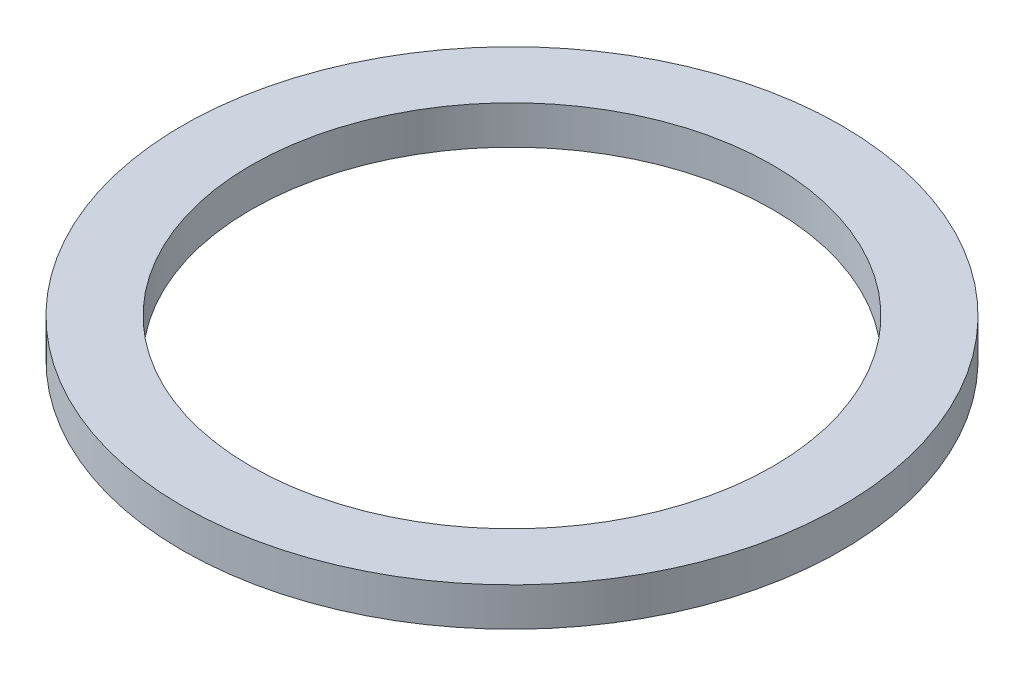
ISO-10303-21;
HEADER;
FILE_DESCRIPTION(('STEP AP214'),'2;1');
FILE_NAME('part.step','',(''),(''),'','','');
FILE_SCHEMA(('AUTOMOTIVE_DESIGN { 1 0 10303 214 1 1 1 1 }'));
ENDSEC;
DATA;
#1=APPLICATION_CONTEXT('core data for automotive mechanical design processes');
#2=APPLICATION_PROTOCOL_DEFINITION('international standard','automotive_design',2000,#1);
#3=PRODUCT_CONTEXT('',#1,'mechanical');
#4=PRODUCT('Part','Part','',(#3));
#5=PRODUCT_RELATED_PRODUCT_CATEGORY('part','',(#4));
#6=PRODUCT_DEFINITION_FORMATION('','',#4);
#7=PRODUCT_DEFINITION_CONTEXT('part definition',#1,'design');
#8=PRODUCT_DEFINITION('design','',#6,#7);
#9=PRODUCT_DEFINITION_SHAPE('','',#8);
#10=(LENGTH_UNIT() NAMED_UNIT(*) SI_UNIT(.MILLI.,.METRE.));
#11=(NAMED_UNIT(*) PLANE_ANGLE_UNIT() SI_UNIT($,.RADIAN.));
#12=(NAMED_UNIT(*) SI_UNIT($,.STERADIAN.) SOLID_ANGLE_UNIT());
#13=UNCERTAINTY_MEASURE_WITH_UNIT(LENGTH_MEASURE(1.E-05),#10,'distance_accuracy_value','');
#14=(GEOMETRIC_REPRESENTATION_CONTEXT(3) GLOBAL_UNCERTAINTY_ASSIGNED_CONTEXT((#13)) GLOBAL_UNIT_ASSIGNED_CONTEXT((#10,
#11,#12)) REPRESENTATION_CONTEXT('',''));
#15=CARTESIAN_POINT('',(0.,0.,0.));
#16=DIRECTION('',(0.,0.,1.));
#17=DIRECTION('',(1.,0.,0.));
#18=AXIS2_PLACEMENT_3D('',#15,#16,#17);
#19=CARTESIAN_POINT('',(0.,7.,0.));
#20=DIRECTION('',(0.,-1.,0.));
#21=DIRECTION('',(0.,0.,-1.));
#22=AXIS2_PLACEMENT_3D('',#19,#20,#21);
#23=CYLINDRICAL_SURFACE('',#22,60.);
#24=CARTESIAN_POINT('',(0.,7.,0.));
#25=DIRECTION('',(0.,1.,0.));
#26=DIRECTION('',(0.,0.,1.));
#27=AXIS2_PLACEMENT_3D('',#24,#25,#26);
#28=CIRCLE('',#27,60.);
#29=CARTESIAN_POINT('',(0.,7.,60.));
#30=VERTEX_POINT('',#29);
#31=EDGE_CURVE('E10',#30,#30,#28,.T.);
#32=ORIENTED_EDGE('',*,*,#31,.F.);
#33=EDGE_LOOP('',(#32));
#34=FACE_BOUND('',#33,.T.);
#35=CARTESIAN_POINT('',(0.,0.,0.));
#36=DIRECTION('',(0.,1.,0.));
#37=DIRECTION('',(0.,0.,1.));
#38=AXIS2_PLACEMENT_3D('',#35,#36,#37);
#39=CIRCLE('',#38,60.);
#40=CARTESIAN_POINT('',(0.,0.,60.));
#41=VERTEX_POINT('',#40);
#42=EDGE_CURVE('E37',#41,#41,#39,.T.);
#43=ORIENTED_EDGE('',*,*,#42,.T.);
#44=EDGE_LOOP('',(#43));
#45=FACE_BOUND('',#44,.T.);
#46=ADVANCED_FACE('F40',(#34,#45),#23,.T.);
#47=CARTESIAN_POINT('',(0.,7.,0.));
#48=DIRECTION('',(0.,1.,0.));
#49=DIRECTION('',(0.,0.,1.));
#50=AXIS2_PLACEMENT_3D('',#47,#48,#49);
#51=PLANE('',#50);
#52=CARTESIAN_POINT('',(0.,7.,0.));
#53=DIRECTION('',(0.,1.,0.));
#54=DIRECTION('',(0.,0.,1.));
#55=AXIS2_PLACEMENT_3D('',#52,#53,#54);
#56=CIRCLE('',#55,47.5);
#57=CARTESIAN_POINT('',(0.,7.,47.5));
#58=VERTEX_POINT('',#57);
#59=EDGE_CURVE('E50',#58,#58,#56,.T.);
#60=ORIENTED_EDGE('',*,*,#59,.F.);
#61=EDGE_LOOP('',(#60));
#62=FACE_BOUND('',#61,.T.);
#63=ORIENTED_EDGE('',*,*,#31,.T.);
#64=EDGE_LOOP('',(#63));
#65=FACE_BOUND('',#64,.T.);
#66=ADVANCED_FACE('F59',(#62,#65),#51,.T.);
#67=CARTESIAN_POINT('',(0.,0.,0.));
#68=DIRECTION('',(0.,1.,0.));
#69=DIRECTION('',(0.,0.,1.));
#70=AXIS2_PLACEMENT_3D('',#67,#68,#69);
#71=PLANE('',#70);
#72=CARTESIAN_POINT('',(0.,0.,0.));
#73=DIRECTION('',(0.,1.,0.));
#74=DIRECTION('',(0.,0.,1.));
#75=AXIS2_PLACEMENT_3D('',#72,#73,#74);
#76=CIRCLE('',#75,47.5);
#77=CARTESIAN_POINT('',(0.,0.,47.5));
#78=VERTEX_POINT('',#77);
#79=EDGE_CURVE('E47',#78,#78,#76,.T.);
#80=ORIENTED_EDGE('',*,*,#79,.T.);
#81=EDGE_LOOP('',(#80));
#82=FACE_BOUND('',#81,.T.);
#83=ORIENTED_EDGE('',*,*,#42,.F.);
#84=EDGE_LOOP('',(#83));
#85=FACE_BOUND('',#84,.T.);
#86=ADVANCED_FACE('F58',(#82,#85),#71,.F.);
#87=CARTESIAN_POINT('',(0.,7.,0.));
#88=DIRECTION('',(0.,-1.,0.));
#89=DIRECTION('',(0.,0.,-1.));
#90=AXIS2_PLACEMENT_3D('',#87,#88,#89);
#91=CYLINDRICAL_SURFACE('',#90,47.5);
#92=ORIENTED_EDGE('',*,*,#59,.T.);
#93=EDGE_LOOP('',(#92));
#94=FACE_BOUND('',#93,.T.);
#95=ORIENTED_EDGE('',*,*,#79,.F.);
#96=EDGE_LOOP('',(#95));
#97=FACE_BOUND('',#96,.T.);
#98=ADVANCED_FACE('F54',(#94,#97),#91,.F.);
#99=CLOSED_SHELL('',(#46,#66,#86,#98));
#100=MANIFOLD_SOLID_BREP('B2',#99);
#101=ADVANCED_BREP_SHAPE_REPRESENTATION('',(#18,#100),#14);
#102=SHAPE_DEFINITION_REPRESENTATION(#9,#101);
ENDSEC;
END-ISO-10303-21;
